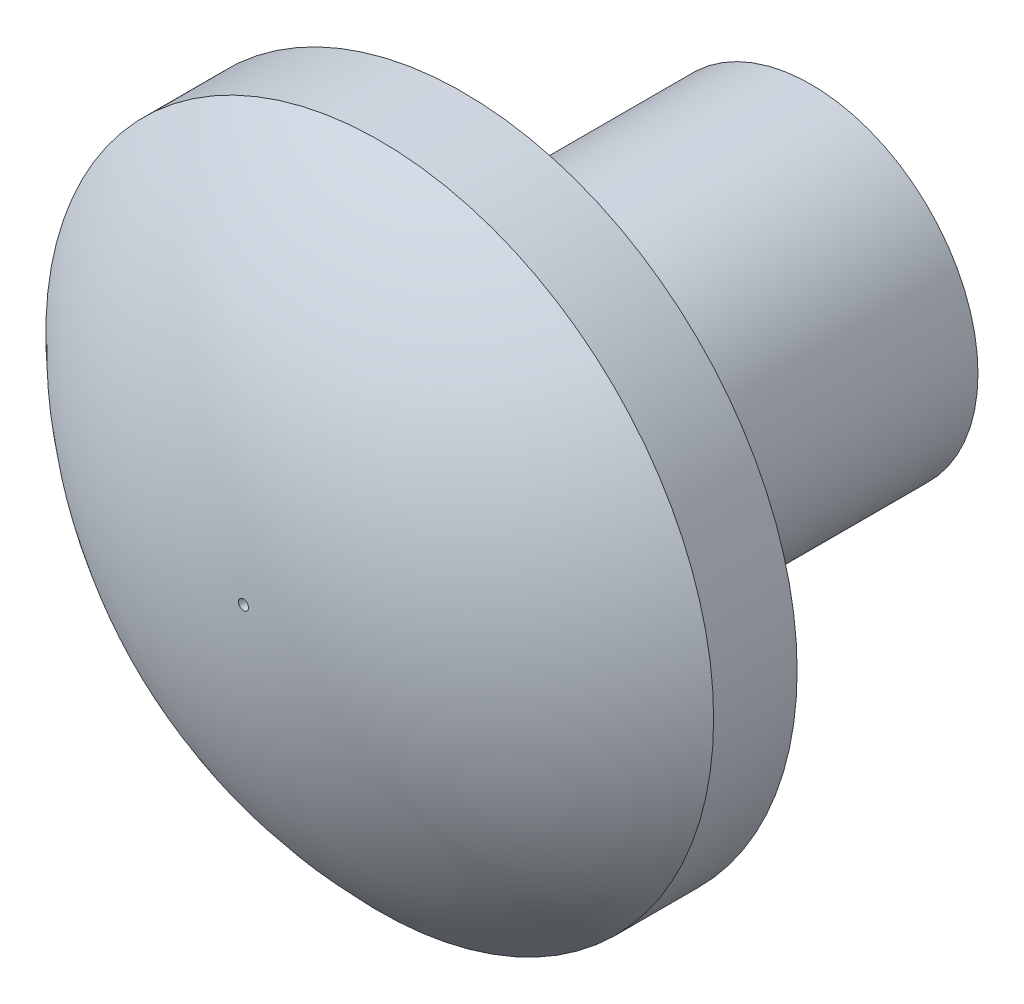
ISO-10303-21;
HEADER;
FILE_DESCRIPTION(('STEP AP214'),'2;1');
FILE_NAME('part.step','',(''),(''),'','','');
FILE_SCHEMA(('AUTOMOTIVE_DESIGN { 1 0 10303 214 1 1 1 1 }'));
ENDSEC;
DATA;
#1=APPLICATION_CONTEXT('core data for automotive mechanical design processes');
#2=APPLICATION_PROTOCOL_DEFINITION('international standard','automotive_design',2000,#1);
#3=PRODUCT_CONTEXT('',#1,'mechanical');
#4=PRODUCT('Part','Part','',(#3));
#5=PRODUCT_RELATED_PRODUCT_CATEGORY('part','',(#4));
#6=PRODUCT_DEFINITION_FORMATION('','',#4);
#7=PRODUCT_DEFINITION_CONTEXT('part definition',#1,'design');
#8=PRODUCT_DEFINITION('design','',#6,#7);
#9=PRODUCT_DEFINITION_SHAPE('','',#8);
#10=(LENGTH_UNIT() NAMED_UNIT(*) SI_UNIT(.MILLI.,.METRE.));
#11=(NAMED_UNIT(*) PLANE_ANGLE_UNIT() SI_UNIT($,.RADIAN.));
#12=(NAMED_UNIT(*) SI_UNIT($,.STERADIAN.) SOLID_ANGLE_UNIT());
#13=UNCERTAINTY_MEASURE_WITH_UNIT(LENGTH_MEASURE(1.E-05),#10,'distance_accuracy_value','');
#14=(GEOMETRIC_REPRESENTATION_CONTEXT(3) GLOBAL_UNCERTAINTY_ASSIGNED_CONTEXT((#13)) GLOBAL_UNIT_ASSIGNED_CONTEXT((#10,
#11,#12)) REPRESENTATION_CONTEXT('',''));
#15=CARTESIAN_POINT('',(0.,0.,0.));
#16=DIRECTION('',(0.,0.,1.));
#17=DIRECTION('',(1.,0.,0.));
#18=AXIS2_PLACEMENT_3D('',#15,#16,#17);
#19=CARTESIAN_POINT('',(0.,0.,6.25));
#20=DIRECTION('',(0.,0.,-1.));
#21=DIRECTION('',(-1.,0.,0.));
#22=AXIS2_PLACEMENT_3D('',#19,#20,#21);
#23=CYLINDRICAL_SURFACE('',#22,3.);
#24=CARTESIAN_POINT('',(0.,0.,6.25));
#25=DIRECTION('',(0.,0.,1.));
#26=DIRECTION('',(1.,0.,0.));
#27=AXIS2_PLACEMENT_3D('',#24,#25,#26);
#28=CIRCLE('',#27,3.);
#29=CARTESIAN_POINT('',(3.,0.,6.25));
#30=VERTEX_POINT('',#29);
#31=EDGE_CURVE('E10',#30,#30,#28,.T.);
#32=ORIENTED_EDGE('',*,*,#31,.F.);
#33=EDGE_LOOP('',(#32));
#34=FACE_BOUND('',#33,.T.);
#35=CARTESIAN_POINT('',(0.,0.,0.));
#36=DIRECTION('',(0.,0.,1.));
#37=DIRECTION('',(1.,0.,0.));
#38=AXIS2_PLACEMENT_3D('',#35,#36,#37);
#39=CIRCLE('',#38,3.);
#40=CARTESIAN_POINT('',(3.,0.,0.));
#41=VERTEX_POINT('',#40);
#42=EDGE_CURVE('E42',#41,#41,#39,.T.);
#43=ORIENTED_EDGE('',*,*,#42,.T.);
#44=EDGE_LOOP('',(#43));
#45=FACE_BOUND('',#44,.T.);
#46=ADVANCED_FACE('F39',(#34,#45),#23,.T.);
#47=CARTESIAN_POINT('',(0.,0.,0.));
#48=DIRECTION('',(0.,0.,1.));
#49=DIRECTION('',(1.,0.,0.));
#50=AXIS2_PLACEMENT_3D('',#47,#48,#49);
#51=PLANE('',#50);
#52=ORIENTED_EDGE('',*,*,#42,.F.);
#53=EDGE_LOOP('',(#52));
#54=FACE_BOUND('',#53,.T.);
#55=ADVANCED_FACE('F87',(#54),#51,.F.);
#56=CARTESIAN_POINT('',(0.,0.,7.75));
#57=DIRECTION('',(0.,0.,-1.));
#58=DIRECTION('',(-1.,0.,0.));
#59=AXIS2_PLACEMENT_3D('',#56,#57,#58);
#60=CYLINDRICAL_SURFACE('',#59,6.);
#61=CARTESIAN_POINT('',(0.,0.,7.75));
#62=DIRECTION('',(0.,0.,1.));
#63=DIRECTION('',(1.,0.,0.));
#64=AXIS2_PLACEMENT_3D('',#61,#62,#63);
#65=CIRCLE('',#64,6.);
#66=CARTESIAN_POINT('',(6.,0.,7.75));
#67=VERTEX_POINT('',#66);
#68=EDGE_CURVE('E51',#67,#67,#65,.T.);
#69=ORIENTED_EDGE('',*,*,#68,.F.);
#70=EDGE_LOOP('',(#69));
#71=FACE_BOUND('',#70,.T.);
#72=CARTESIAN_POINT('',(0.,0.,6.25));
#73=DIRECTION('',(0.,0.,1.));
#74=DIRECTION('',(1.,0.,0.));
#75=AXIS2_PLACEMENT_3D('',#72,#73,#74);
#76=CIRCLE('',#75,6.);
#77=CARTESIAN_POINT('',(6.,0.,6.25));
#78=VERTEX_POINT('',#77);
#79=EDGE_CURVE('E53',#78,#78,#76,.T.);
#80=ORIENTED_EDGE('',*,*,#79,.T.);
#81=EDGE_LOOP('',(#80));
#82=FACE_BOUND('',#81,.T.);
#83=ADVANCED_FACE('F84',(#71,#82),#60,.T.);
#84=CARTESIAN_POINT('',(0.,0.,6.25));
#85=DIRECTION('',(0.,0.,1.));
#86=DIRECTION('',(1.,0.,0.));
#87=AXIS2_PLACEMENT_3D('',#84,#85,#86);
#88=PLANE('',#87);
#89=ORIENTED_EDGE('',*,*,#31,.T.);
#90=EDGE_LOOP('',(#89));
#91=FACE_BOUND('',#90,.T.);
#92=ORIENTED_EDGE('',*,*,#79,.F.);
#93=EDGE_LOOP('',(#92));
#94=FACE_BOUND('',#93,.T.);
#95=ADVANCED_FACE('F80',(#91,#94),#88,.F.);
#96=CARTESIAN_POINT('',(0.,0.,1.84036268997607));
#97=DIRECTION('',(0.,0.,1.));
#98=DIRECTION('',(1.,0.,0.));
#99=AXIS2_PLACEMENT_3D('',#96,#97,#98);
#100=DEGENERATE_TOROIDAL_SURFACE('',#99,0.0903626899760894,8.35748923254188,.T.);
#101=CARTESIAN_POINT('',(0.,0.,10.197851922518));
#102=DIRECTION('',(0.,0.,1.));
#103=DIRECTION('',(1.,0.,0.));
#104=AXIS2_PLACEMENT_3D('',#101,#102,#103);
#105=CIRCLE('',#104,0.0903626899760904);
#106=CARTESIAN_POINT('',(0.0903626899760904,0.,10.197851922518));
#107=VERTEX_POINT('',#106);
#108=EDGE_CURVE('E57',#107,#107,#105,.T.);
#109=ORIENTED_EDGE('',*,*,#108,.F.);
#110=EDGE_LOOP('',(#109));
#111=FACE_BOUND('',#110,.T.);
#112=ORIENTED_EDGE('',*,*,#68,.T.);
#113=EDGE_LOOP('',(#112));
#114=FACE_BOUND('',#113,.T.);
#115=ADVANCED_FACE('F74',(#111,#114),#100,.T.);
#116=CARTESIAN_POINT('',(0.,0.,6.25));
#117=DIRECTION('',(0.,0.,1.));
#118=DIRECTION('',(1.,0.,0.));
#119=AXIS2_PLACEMENT_3D('',#116,#117,#118);
#120=CYLINDRICAL_SURFACE('',#119,0.0903626899760907);
#121=CARTESIAN_POINT('',(0.,0.,7.75));
#122=DIRECTION('',(0.,0.,1.));
#123=DIRECTION('',(1.,0.,0.));
#124=AXIS2_PLACEMENT_3D('',#121,#122,#123);
#125=CIRCLE('',#124,0.0903626899760911);
#126=CARTESIAN_POINT('',(0.0903626899760911,0.,7.75));
#127=VERTEX_POINT('',#126);
#128=EDGE_CURVE('E64',#127,#127,#125,.T.);
#129=ORIENTED_EDGE('',*,*,#128,.F.);
#130=EDGE_LOOP('',(#129));
#131=FACE_BOUND('',#130,.T.);
#132=ORIENTED_EDGE('',*,*,#108,.T.);
#133=EDGE_LOOP('',(#132));
#134=FACE_BOUND('',#133,.T.);
#135=ADVANCED_FACE('F71',(#131,#134),#120,.F.);
#136=CARTESIAN_POINT('',(0.,0.,7.75));
#137=DIRECTION('',(0.,0.,1.));
#138=DIRECTION('',(1.,0.,0.));
#139=AXIS2_PLACEMENT_3D('',#136,#137,#138);
#140=PLANE('',#139);
#141=ORIENTED_EDGE('',*,*,#128,.T.);
#142=EDGE_LOOP('',(#141));
#143=FACE_BOUND('',#142,.T.);
#144=ADVANCED_FACE('F69',(#143),#140,.T.);
#145=CLOSED_SHELL('',(#46,#55,#83,#95,#115,#135,#144));
#146=MANIFOLD_SOLID_BREP('B2',#145);
#147=ADVANCED_BREP_SHAPE_REPRESENTATION('',(#18,#146),#14);
#148=SHAPE_DEFINITION_REPRESENTATION(#9,#147);
ENDSEC;
END-ISO-10303-21;
